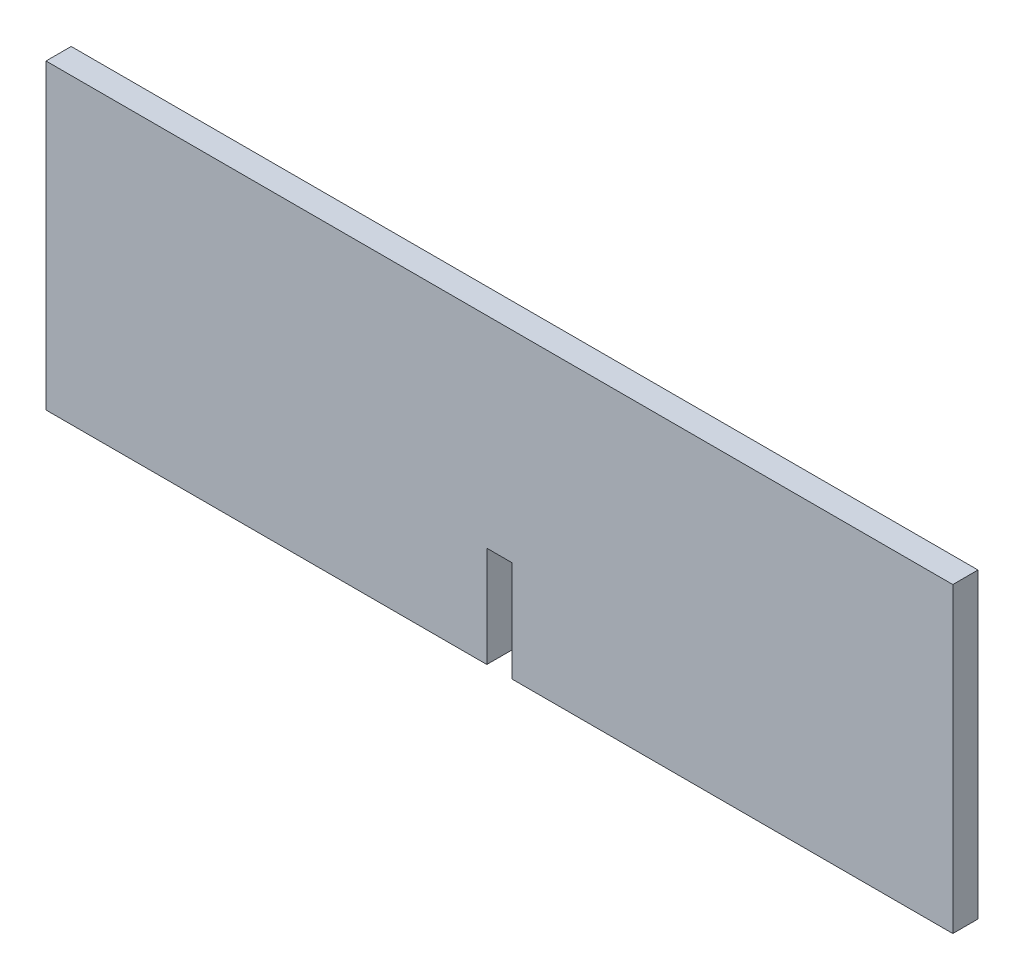
ISO-10303-21;
HEADER;
FILE_DESCRIPTION(('STEP AP214'),'2;1');
FILE_NAME('part.step','',(''),(''),'','','');
FILE_SCHEMA(('AUTOMOTIVE_DESIGN { 1 0 10303 214 1 1 1 1 }'));
ENDSEC;
DATA;
#1=APPLICATION_CONTEXT('core data for automotive mechanical design processes');
#2=APPLICATION_PROTOCOL_DEFINITION('international standard','automotive_design',2000,#1);
#3=PRODUCT_CONTEXT('',#1,'mechanical');
#4=PRODUCT('Part','Part','',(#3));
#5=PRODUCT_RELATED_PRODUCT_CATEGORY('part','',(#4));
#6=PRODUCT_DEFINITION_FORMATION('','',#4);
#7=PRODUCT_DEFINITION_CONTEXT('part definition',#1,'design');
#8=PRODUCT_DEFINITION('design','',#6,#7);
#9=PRODUCT_DEFINITION_SHAPE('','',#8);
#10=(LENGTH_UNIT() NAMED_UNIT(*) SI_UNIT(.MILLI.,.METRE.));
#11=(NAMED_UNIT(*) PLANE_ANGLE_UNIT() SI_UNIT($,.RADIAN.));
#12=(NAMED_UNIT(*) SI_UNIT($,.STERADIAN.) SOLID_ANGLE_UNIT());
#13=UNCERTAINTY_MEASURE_WITH_UNIT(LENGTH_MEASURE(1.E-05),#10,'distance_accuracy_value','');
#14=(GEOMETRIC_REPRESENTATION_CONTEXT(3) GLOBAL_UNCERTAINTY_ASSIGNED_CONTEXT((#13)) GLOBAL_UNIT_ASSIGNED_CONTEXT((#10,
#11,#12)) REPRESENTATION_CONTEXT('',''));
#15=CARTESIAN_POINT('',(0.,0.,0.));
#16=DIRECTION('',(0.,0.,1.));
#17=DIRECTION('',(1.,0.,0.));
#18=AXIS2_PLACEMENT_3D('',#15,#16,#17);
#19=CARTESIAN_POINT('',(-553.067486259618,0.,38.1));
#20=DIRECTION('',(0.,-1.,0.));
#21=DIRECTION('',(0.,0.,-1.));
#22=AXIS2_PLACEMENT_3D('',#19,#20,#21);
#23=PLANE('',#22);
#24=DIRECTION('',(0.,0.,-1.));
#25=VECTOR('',#24,1.);
#26=CARTESIAN_POINT('',(-704.85,0.,19.05));
#27=LINE('',#26,#25);
#28=CARTESIAN_POINT('',(-704.85,0.,38.1));
#29=VERTEX_POINT('',#28);
#30=CARTESIAN_POINT('',(-704.85,0.,0.));
#31=VERTEX_POINT('',#30);
#32=EDGE_CURVE('E205',#29,#31,#27,.T.);
#33=ORIENTED_EDGE('',*,*,#32,.F.);
#34=DIRECTION('',(-1.,0.,0.));
#35=VECTOR('',#34,1.);
#36=CARTESIAN_POINT('',(-553.067486259618,0.,38.1));
#37=LINE('',#36,#35);
#38=CARTESIAN_POINT('',(-1371.6,-1.11022302462516E-13,38.1));
#39=VERTEX_POINT('',#38);
#40=EDGE_CURVE('E52',#29,#39,#37,.T.);
#41=ORIENTED_EDGE('',*,*,#40,.T.);
#42=DIRECTION('',(0.,0.,-1.));
#43=VECTOR('',#42,1.);
#44=CARTESIAN_POINT('',(-1371.6,-1.11022302462516E-13,38.1));
#45=LINE('',#44,#43);
#46=CARTESIAN_POINT('',(-1371.6,-1.11022302462516E-13,0.));
#47=VERTEX_POINT('',#46);
#48=EDGE_CURVE('E158',#39,#47,#45,.T.);
#49=ORIENTED_EDGE('',*,*,#48,.T.);
#50=DIRECTION('',(-1.,0.,0.));
#51=VECTOR('',#50,1.);
#52=CARTESIAN_POINT('',(-553.067486259618,0.,0.));
#53=LINE('',#52,#51);
#54=EDGE_CURVE('E79',#31,#47,#53,.T.);
#55=ORIENTED_EDGE('',*,*,#54,.F.);
#56=EDGE_LOOP('',(#33,#41,#49,#55));
#57=FACE_BOUND('',#56,.T.);
#58=ADVANCED_FACE('F18',(#57),#23,.T.);
#59=CARTESIAN_POINT('',(-685.8,228.6,38.1));
#60=DIRECTION('',(0.,0.,1.));
#61=DIRECTION('',(1.,0.,0.));
#62=AXIS2_PLACEMENT_3D('',#59,#60,#61);
#63=PLANE('',#62);
#64=DIRECTION('',(-1.,0.,0.));
#65=VECTOR('',#64,1.);
#66=CARTESIAN_POINT('',(-553.067486259618,152.4,38.1));
#67=LINE('',#66,#65);
#68=CARTESIAN_POINT('',(-666.75,152.4,38.1));
#69=VERTEX_POINT('',#68);
#70=CARTESIAN_POINT('',(-704.85,152.4,38.1));
#71=VERTEX_POINT('',#70);
#72=EDGE_CURVE('E121',#69,#71,#67,.T.);
#73=ORIENTED_EDGE('',*,*,#72,.F.);
#74=DIRECTION('',(0.,-1.,0.));
#75=VECTOR('',#74,1.);
#76=CARTESIAN_POINT('',(-666.75,152.4,38.1));
#77=LINE('',#76,#75);
#78=CARTESIAN_POINT('',(-666.75,0.,38.1));
#79=VERTEX_POINT('',#78);
#80=EDGE_CURVE('E215',#69,#79,#77,.T.);
#81=ORIENTED_EDGE('',*,*,#80,.T.);
#82=CARTESIAN_POINT('',(0.,0.,38.1));
#83=VERTEX_POINT('',#82);
#84=EDGE_CURVE('E146',#83,#79,#37,.T.);
#85=ORIENTED_EDGE('',*,*,#84,.F.);
#86=DIRECTION('',(0.,1.,0.));
#87=VECTOR('',#86,1.);
#88=CARTESIAN_POINT('',(0.,228.6,38.1));
#89=LINE('',#88,#87);
#90=CARTESIAN_POINT('',(0.,457.2,38.1));
#91=VERTEX_POINT('',#90);
#92=EDGE_CURVE('E149',#83,#91,#89,.T.);
#93=ORIENTED_EDGE('',*,*,#92,.T.);
#94=DIRECTION('',(-1.,0.,0.));
#95=VECTOR('',#94,1.);
#96=CARTESIAN_POINT('',(-553.067486259618,457.2,38.1));
#97=LINE('',#96,#95);
#98=CARTESIAN_POINT('',(-1371.6,457.2,38.1));
#99=VERTEX_POINT('',#98);
#100=EDGE_CURVE('E152',#91,#99,#97,.T.);
#101=ORIENTED_EDGE('',*,*,#100,.T.);
#102=DIRECTION('',(0.,1.,0.));
#103=VECTOR('',#102,1.);
#104=CARTESIAN_POINT('',(-1371.6,228.6,38.1));
#105=LINE('',#104,#103);
#106=EDGE_CURVE('E155',#39,#99,#105,.T.);
#107=ORIENTED_EDGE('',*,*,#106,.F.);
#108=ORIENTED_EDGE('',*,*,#40,.F.);
#109=DIRECTION('',(0.,-1.,0.));
#110=VECTOR('',#109,1.);
#111=CARTESIAN_POINT('',(-704.85,152.4,38.1));
#112=LINE('',#111,#110);
#113=EDGE_CURVE('E116',#71,#29,#112,.T.);
#114=ORIENTED_EDGE('',*,*,#113,.F.);
#115=EDGE_LOOP('',(#73,#81,#85,#93,#101,#107,#108,#114));
#116=FACE_BOUND('',#115,.T.);
#117=ADVANCED_FACE('F133',(#116),#63,.T.);
#118=DIRECTION('',(0.,0.,1.));
#119=VECTOR('',#118,1.);
#120=CARTESIAN_POINT('',(-666.75,0.,19.05));
#121=LINE('',#120,#119);
#122=CARTESIAN_POINT('',(-666.75,0.,0.));
#123=VERTEX_POINT('',#122);
#124=EDGE_CURVE('E131',#123,#79,#121,.T.);
#125=ORIENTED_EDGE('',*,*,#124,.F.);
#126=CARTESIAN_POINT('',(0.,0.,0.));
#127=VERTEX_POINT('',#126);
#128=EDGE_CURVE('E140',#127,#123,#53,.T.);
#129=ORIENTED_EDGE('',*,*,#128,.F.);
#130=DIRECTION('',(0.,0.,-1.));
#131=VECTOR('',#130,1.);
#132=CARTESIAN_POINT('',(0.,0.,38.1));
#133=LINE('',#132,#131);
#134=EDGE_CURVE('E11',#83,#127,#133,.T.);
#135=ORIENTED_EDGE('',*,*,#134,.F.);
#136=ORIENTED_EDGE('',*,*,#84,.T.);
#137=EDGE_LOOP('',(#125,#129,#135,#136));
#138=FACE_BOUND('',#137,.T.);
#139=ADVANCED_FACE('F20',(#138),#23,.T.);
#140=CARTESIAN_POINT('',(0.,228.6,38.1));
#141=DIRECTION('',(-1.,0.,0.));
#142=DIRECTION('',(0.,0.,1.));
#143=AXIS2_PLACEMENT_3D('',#140,#141,#142);
#144=PLANE('',#143);
#145=DIRECTION('',(0.,1.,0.));
#146=VECTOR('',#145,1.);
#147=CARTESIAN_POINT('',(0.,228.6,0.));
#148=LINE('',#147,#146);
#149=CARTESIAN_POINT('',(0.,457.2,0.));
#150=VERTEX_POINT('',#149);
#151=EDGE_CURVE('E162',#127,#150,#148,.T.);
#152=ORIENTED_EDGE('',*,*,#151,.T.);
#153=DIRECTION('',(0.,0.,-1.));
#154=VECTOR('',#153,1.);
#155=CARTESIAN_POINT('',(0.,457.2,38.1));
#156=LINE('',#155,#154);
#157=EDGE_CURVE('E27',#91,#150,#156,.T.);
#158=ORIENTED_EDGE('',*,*,#157,.F.);
#159=ORIENTED_EDGE('',*,*,#92,.F.);
#160=ORIENTED_EDGE('',*,*,#134,.T.);
#161=EDGE_LOOP('',(#152,#158,#159,#160));
#162=FACE_BOUND('',#161,.T.);
#163=ADVANCED_FACE('F192',(#162),#144,.F.);
#164=CARTESIAN_POINT('',(-553.067486259618,457.2,38.1));
#165=DIRECTION('',(0.,-1.,0.));
#166=DIRECTION('',(0.,0.,-1.));
#167=AXIS2_PLACEMENT_3D('',#164,#165,#166);
#168=PLANE('',#167);
#169=DIRECTION('',(-1.,0.,0.));
#170=VECTOR('',#169,1.);
#171=CARTESIAN_POINT('',(-553.067486259618,457.2,0.));
#172=LINE('',#171,#170);
#173=CARTESIAN_POINT('',(-1371.6,457.2,0.));
#174=VERTEX_POINT('',#173);
#175=EDGE_CURVE('E165',#150,#174,#172,.T.);
#176=ORIENTED_EDGE('',*,*,#175,.T.);
#177=DIRECTION('',(0.,0.,-1.));
#178=VECTOR('',#177,1.);
#179=CARTESIAN_POINT('',(-1371.6,457.2,38.1));
#180=LINE('',#179,#178);
#181=EDGE_CURVE('E174',#99,#174,#180,.T.);
#182=ORIENTED_EDGE('',*,*,#181,.F.);
#183=ORIENTED_EDGE('',*,*,#100,.F.);
#184=ORIENTED_EDGE('',*,*,#157,.T.);
#185=EDGE_LOOP('',(#176,#182,#183,#184));
#186=FACE_BOUND('',#185,.T.);
#187=ADVANCED_FACE('F183',(#186),#168,.F.);
#188=CARTESIAN_POINT('',(-1371.6,228.6,38.1));
#189=DIRECTION('',(-1.,0.,0.));
#190=DIRECTION('',(0.,-1.,0.));
#191=AXIS2_PLACEMENT_3D('',#188,#189,#190);
#192=PLANE('',#191);
#193=DIRECTION('',(0.,1.,0.));
#194=VECTOR('',#193,1.);
#195=CARTESIAN_POINT('',(-1371.6,228.6,0.));
#196=LINE('',#195,#194);
#197=EDGE_CURVE('E169',#47,#174,#196,.T.);
#198=ORIENTED_EDGE('',*,*,#197,.F.);
#199=ORIENTED_EDGE('',*,*,#48,.F.);
#200=ORIENTED_EDGE('',*,*,#106,.T.);
#201=ORIENTED_EDGE('',*,*,#181,.T.);
#202=EDGE_LOOP('',(#198,#199,#200,#201));
#203=FACE_BOUND('',#202,.T.);
#204=ADVANCED_FACE('F190',(#203),#192,.T.);
#205=CARTESIAN_POINT('',(-685.8,228.6,0.));
#206=DIRECTION('',(0.,0.,1.));
#207=DIRECTION('',(1.,0.,0.));
#208=AXIS2_PLACEMENT_3D('',#205,#206,#207);
#209=PLANE('',#208);
#210=DIRECTION('',(-1.,0.,0.));
#211=VECTOR('',#210,1.);
#212=CARTESIAN_POINT('',(-553.067486259618,152.4,0.));
#213=LINE('',#212,#211);
#214=CARTESIAN_POINT('',(-666.75,152.4,0.));
#215=VERTEX_POINT('',#214);
#216=CARTESIAN_POINT('',(-704.85,152.4,0.));
#217=VERTEX_POINT('',#216);
#218=EDGE_CURVE('E120',#215,#217,#213,.T.);
#219=ORIENTED_EDGE('',*,*,#218,.T.);
#220=DIRECTION('',(0.,-1.,0.));
#221=VECTOR('',#220,1.);
#222=CARTESIAN_POINT('',(-704.85,152.4,0.));
#223=LINE('',#222,#221);
#224=EDGE_CURVE('E117',#217,#31,#223,.T.);
#225=ORIENTED_EDGE('',*,*,#224,.T.);
#226=ORIENTED_EDGE('',*,*,#54,.T.);
#227=ORIENTED_EDGE('',*,*,#197,.T.);
#228=ORIENTED_EDGE('',*,*,#175,.F.);
#229=ORIENTED_EDGE('',*,*,#151,.F.);
#230=ORIENTED_EDGE('',*,*,#128,.T.);
#231=DIRECTION('',(0.,-1.,0.));
#232=VECTOR('',#231,1.);
#233=CARTESIAN_POINT('',(-666.75,152.4,0.));
#234=LINE('',#233,#232);
#235=EDGE_CURVE('E142',#215,#123,#234,.T.);
#236=ORIENTED_EDGE('',*,*,#235,.F.);
#237=EDGE_LOOP('',(#219,#225,#226,#227,#228,#229,#230,#236));
#238=FACE_BOUND('',#237,.T.);
#239=ADVANCED_FACE('F187',(#238),#209,.F.);
#240=CARTESIAN_POINT('',(-704.85,152.4,19.05));
#241=DIRECTION('',(-1.,0.,0.));
#242=DIRECTION('',(0.,0.,1.));
#243=AXIS2_PLACEMENT_3D('',#240,#241,#242);
#244=PLANE('',#243);
#245=ORIENTED_EDGE('',*,*,#32,.T.);
#246=ORIENTED_EDGE('',*,*,#224,.F.);
#247=DIRECTION('',(0.,0.,-1.));
#248=VECTOR('',#247,1.);
#249=CARTESIAN_POINT('',(-704.85,152.4,19.05));
#250=LINE('',#249,#248);
#251=EDGE_CURVE('E39',#71,#217,#250,.T.);
#252=ORIENTED_EDGE('',*,*,#251,.F.);
#253=ORIENTED_EDGE('',*,*,#113,.T.);
#254=EDGE_LOOP('',(#245,#246,#252,#253));
#255=FACE_BOUND('',#254,.T.);
#256=ADVANCED_FACE('F114',(#255),#244,.F.);
#257=CARTESIAN_POINT('',(-666.75,152.4,19.05));
#258=DIRECTION('',(1.,0.,0.));
#259=DIRECTION('',(0.,0.,-1.));
#260=AXIS2_PLACEMENT_3D('',#257,#258,#259);
#261=PLANE('',#260);
#262=ORIENTED_EDGE('',*,*,#124,.T.);
#263=ORIENTED_EDGE('',*,*,#80,.F.);
#264=DIRECTION('',(0.,0.,1.));
#265=VECTOR('',#264,1.);
#266=CARTESIAN_POINT('',(-666.75,152.4,19.05));
#267=LINE('',#266,#265);
#268=EDGE_CURVE('E127',#215,#69,#267,.T.);
#269=ORIENTED_EDGE('',*,*,#268,.F.);
#270=ORIENTED_EDGE('',*,*,#235,.T.);
#271=EDGE_LOOP('',(#262,#263,#269,#270));
#272=FACE_BOUND('',#271,.T.);
#273=ADVANCED_FACE('F221',(#272),#261,.F.);
#274=CARTESIAN_POINT('',(-685.8,152.4,19.05));
#275=DIRECTION('',(0.,-1.,0.));
#276=DIRECTION('',(1.,0.,0.));
#277=AXIS2_PLACEMENT_3D('',#274,#275,#276);
#278=PLANE('',#277);
#279=ORIENTED_EDGE('',*,*,#72,.T.);
#280=ORIENTED_EDGE('',*,*,#251,.T.);
#281=ORIENTED_EDGE('',*,*,#218,.F.);
#282=ORIENTED_EDGE('',*,*,#268,.T.);
#283=EDGE_LOOP('',(#279,#280,#281,#282));
#284=FACE_BOUND('',#283,.T.);
#285=ADVANCED_FACE('F125',(#284),#278,.T.);
#286=CLOSED_SHELL('',(#58,#117,#139,#163,#187,#204,#239,#256,#273,#285));
#287=MANIFOLD_SOLID_BREP('B1',#286);
#288=ADVANCED_BREP_SHAPE_REPRESENTATION('',(#18,#287),#14);
#289=SHAPE_DEFINITION_REPRESENTATION(#9,#288);
ENDSEC;
END-ISO-10303-21;
